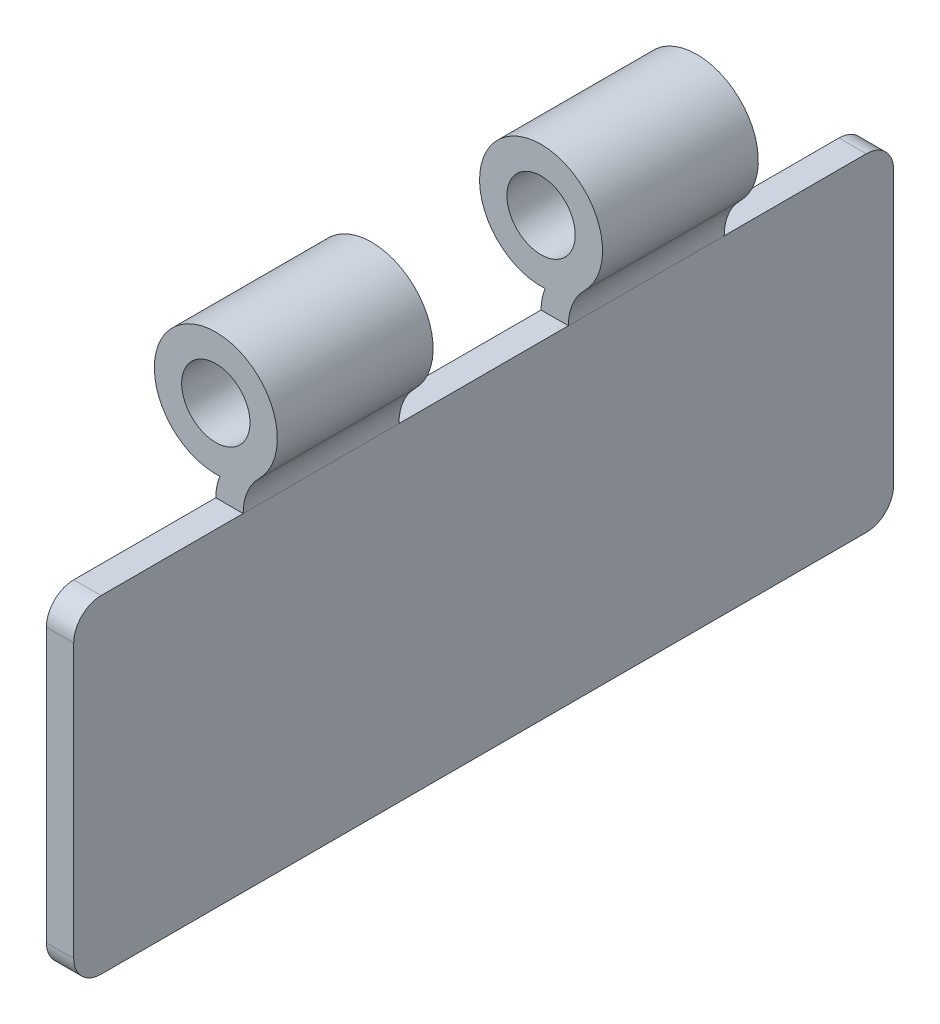
ISO-10303-21;
HEADER;
FILE_DESCRIPTION(('STEP AP214'),'2;1');
FILE_NAME('part.step','',(''),(''),'','','');
FILE_SCHEMA(('AUTOMOTIVE_DESIGN { 1 0 10303 214 1 1 1 1 }'));
ENDSEC;
DATA;
#1=APPLICATION_CONTEXT('core data for automotive mechanical design processes');
#2=APPLICATION_PROTOCOL_DEFINITION('international standard','automotive_design',2000,#1);
#3=PRODUCT_CONTEXT('',#1,'mechanical');
#4=PRODUCT('Part','Part','',(#3));
#5=PRODUCT_RELATED_PRODUCT_CATEGORY('part','',(#4));
#6=PRODUCT_DEFINITION_FORMATION('','',#4);
#7=PRODUCT_DEFINITION_CONTEXT('part definition',#1,'design');
#8=PRODUCT_DEFINITION('design','',#6,#7);
#9=PRODUCT_DEFINITION_SHAPE('','',#8);
#10=(LENGTH_UNIT() NAMED_UNIT(*) SI_UNIT(.MILLI.,.METRE.));
#11=(NAMED_UNIT(*) PLANE_ANGLE_UNIT() SI_UNIT($,.RADIAN.));
#12=(NAMED_UNIT(*) SI_UNIT($,.STERADIAN.) SOLID_ANGLE_UNIT());
#13=UNCERTAINTY_MEASURE_WITH_UNIT(LENGTH_MEASURE(1.E-05),#10,'distance_accuracy_value','');
#14=(GEOMETRIC_REPRESENTATION_CONTEXT(3) GLOBAL_UNCERTAINTY_ASSIGNED_CONTEXT((#13)) GLOBAL_UNIT_ASSIGNED_CONTEXT((#10,
#11,#12)) REPRESENTATION_CONTEXT('',''));
#15=CARTESIAN_POINT('',(0.,0.,0.));
#16=DIRECTION('',(0.,0.,1.));
#17=DIRECTION('',(1.,0.,0.));
#18=AXIS2_PLACEMENT_3D('',#15,#16,#17);
#19=CARTESIAN_POINT('',(0.,38.1,38.1));
#20=DIRECTION('',(0.,0.,-1.));
#21=DIRECTION('',(-1.,0.,0.));
#22=AXIS2_PLACEMENT_3D('',#19,#20,#21);
#23=CYLINDRICAL_SURFACE('',#22,5.715);
#24=CARTESIAN_POINT('',(0.,38.1,-22.352));
#25=DIRECTION('',(0.,0.,1.));
#26=DIRECTION('',(1.,0.,0.));
#27=AXIS2_PLACEMENT_3D('',#24,#25,#26);
#28=CIRCLE('',#27,5.715);
#29=CARTESIAN_POINT('',(4.02417159763314,34.0420118343195,-22.352));
#30=VERTEX_POINT('',#29);
#31=CARTESIAN_POINT('',(0.381023909004146,32.3977157400944,-22.352));
#32=VERTEX_POINT('',#31);
#33=EDGE_CURVE('E156',#30,#32,#28,.T.);
#34=ORIENTED_EDGE('',*,*,#33,.T.);
#35=DIRECTION('',(0.,0.,-1.));
#36=VECTOR('',#35,1.);
#37=CARTESIAN_POINT('',(0.381023909004147,32.3977157400944,38.1));
#38=LINE('',#37,#36);
#39=CARTESIAN_POINT('',(0.381023909004147,32.3977157400944,-7.874));
#40=VERTEX_POINT('',#39);
#41=EDGE_CURVE('E204',#40,#32,#38,.T.);
#42=ORIENTED_EDGE('',*,*,#41,.F.);
#43=CARTESIAN_POINT('',(0.,38.1,-7.874));
#44=DIRECTION('',(0.,0.,1.));
#45=DIRECTION('',(1.,0.,0.));
#46=AXIS2_PLACEMENT_3D('',#43,#44,#45);
#47=CIRCLE('',#46,5.715);
#48=CARTESIAN_POINT('',(4.02417159763314,34.0420118343195,-7.874));
#49=VERTEX_POINT('',#48);
#50=EDGE_CURVE('E181',#49,#40,#47,.T.);
#51=ORIENTED_EDGE('',*,*,#50,.F.);
#52=DIRECTION('',(0.,0.,-1.));
#53=VECTOR('',#52,1.);
#54=CARTESIAN_POINT('',(4.02417159763314,34.0420118343195,38.1));
#55=LINE('',#54,#53);
#56=EDGE_CURVE('E175',#49,#30,#55,.T.);
#57=ORIENTED_EDGE('',*,*,#56,.T.);
#58=EDGE_LOOP('',(#34,#42,#51,#57));
#59=FACE_BOUND('',#58,.T.);
#60=ADVANCED_FACE('F42',(#59),#23,.T.);
#61=CARTESIAN_POINT('',(5.0165,30.48,38.1));
#62=DIRECTION('',(0.,0.,-1.));
#63=DIRECTION('',(-1.,0.,0.));
#64=AXIS2_PLACEMENT_3D('',#61,#62,#63);
#65=CYLINDRICAL_SURFACE('',#64,5.0165);
#66=ORIENTED_EDGE('',*,*,#41,.T.);
#67=CARTESIAN_POINT('',(5.0165,30.48,-22.352));
#68=DIRECTION('',(0.,0.,1.));
#69=DIRECTION('',(1.,0.,0.));
#70=AXIS2_PLACEMENT_3D('',#67,#68,#69);
#71=CIRCLE('',#70,5.0165);
#72=CARTESIAN_POINT('',(0.,30.48,-22.352));
#73=VERTEX_POINT('',#72);
#74=EDGE_CURVE('E163',#32,#73,#71,.T.);
#75=ORIENTED_EDGE('',*,*,#74,.T.);
#76=DIRECTION('',(0.,0.,-1.));
#77=VECTOR('',#76,1.);
#78=CARTESIAN_POINT('',(0.,30.48,38.1));
#79=LINE('',#78,#77);
#80=CARTESIAN_POINT('',(0.,30.48,-7.874));
#81=VERTEX_POINT('',#80);
#82=EDGE_CURVE('E201',#81,#73,#79,.T.);
#83=ORIENTED_EDGE('',*,*,#82,.F.);
#84=CARTESIAN_POINT('',(5.0165,30.48,-7.874));
#85=DIRECTION('',(0.,0.,1.));
#86=DIRECTION('',(1.,0.,0.));
#87=AXIS2_PLACEMENT_3D('',#84,#85,#86);
#88=CIRCLE('',#87,5.0165);
#89=EDGE_CURVE('E282',#81,#40,#88,.F.);
#90=ORIENTED_EDGE('',*,*,#89,.T.);
#91=EDGE_LOOP('',(#66,#75,#83,#90));
#92=FACE_BOUND('',#91,.T.);
#93=ADVANCED_FACE('F311',(#92),#65,.T.);
#94=CARTESIAN_POINT('',(0.,38.1,38.1));
#95=DIRECTION('',(0.,0.,-1.));
#96=DIRECTION('',(-1.,0.,0.));
#97=AXIS2_PLACEMENT_3D('',#94,#95,#96);
#98=CYLINDRICAL_SURFACE('',#97,3.175);
#99=CARTESIAN_POINT('',(0.,38.1,-7.874));
#100=DIRECTION('',(0.,0.,1.));
#101=DIRECTION('',(1.,0.,0.));
#102=AXIS2_PLACEMENT_3D('',#99,#100,#101);
#103=CIRCLE('',#102,3.175);
#104=CARTESIAN_POINT('',(3.175,38.1,-7.874));
#105=VERTEX_POINT('',#104);
#106=EDGE_CURVE('E264',#105,#105,#103,.T.);
#107=ORIENTED_EDGE('',*,*,#106,.T.);
#108=EDGE_LOOP('',(#107));
#109=FACE_BOUND('',#108,.T.);
#110=CARTESIAN_POINT('',(0.,38.1,-22.352));
#111=DIRECTION('',(0.,0.,1.));
#112=DIRECTION('',(1.,0.,0.));
#113=AXIS2_PLACEMENT_3D('',#110,#111,#112);
#114=CIRCLE('',#113,3.175);
#115=CARTESIAN_POINT('',(3.175,38.1,-22.352));
#116=VERTEX_POINT('',#115);
#117=EDGE_CURVE('E168',#116,#116,#114,.T.);
#118=ORIENTED_EDGE('',*,*,#117,.F.);
#119=EDGE_LOOP('',(#118));
#120=FACE_BOUND('',#119,.T.);
#121=ADVANCED_FACE('F309',(#109,#120),#98,.F.);
#122=CARTESIAN_POINT('',(7.55650000000001,30.48,38.1));
#123=DIRECTION('',(0.,0.,-1.));
#124=DIRECTION('',(-1.,0.,0.));
#125=AXIS2_PLACEMENT_3D('',#122,#123,#124);
#126=CYLINDRICAL_SURFACE('',#125,5.0165);
#127=CARTESIAN_POINT('',(7.55650000000001,30.48,-22.352));
#128=DIRECTION('',(0.,0.,-1.));
#129=DIRECTION('',(1.,0.,0.));
#130=AXIS2_PLACEMENT_3D('',#127,#128,#129);
#131=CIRCLE('',#130,5.01650000000001);
#132=CARTESIAN_POINT('',(2.54,30.48,-22.352));
#133=VERTEX_POINT('',#132);
#134=EDGE_CURVE('E161',#133,#30,#131,.T.);
#135=ORIENTED_EDGE('',*,*,#134,.T.);
#136=ORIENTED_EDGE('',*,*,#56,.F.);
#137=CARTESIAN_POINT('',(7.55650000000001,30.48,-7.874));
#138=DIRECTION('',(0.,0.,1.));
#139=DIRECTION('',(1.,0.,0.));
#140=AXIS2_PLACEMENT_3D('',#137,#138,#139);
#141=CIRCLE('',#140,5.0165);
#142=CARTESIAN_POINT('',(2.54,30.48,-7.874));
#143=VERTEX_POINT('',#142);
#144=EDGE_CURVE('E259',#143,#49,#141,.F.);
#145=ORIENTED_EDGE('',*,*,#144,.F.);
#146=DIRECTION('',(0.,0.,-1.));
#147=VECTOR('',#146,1.);
#148=CARTESIAN_POINT('',(2.54,30.48,38.1));
#149=LINE('',#148,#147);
#150=EDGE_CURVE('E177',#143,#133,#149,.T.);
#151=ORIENTED_EDGE('',*,*,#150,.T.);
#152=EDGE_LOOP('',(#135,#136,#145,#151));
#153=FACE_BOUND('',#152,.T.);
#154=ADVANCED_FACE('F173',(#153),#126,.F.);
#155=CARTESIAN_POINT('',(0.,0.,-38.1));
#156=DIRECTION('',(0.,0.,1.));
#157=DIRECTION('',(1.,0.,0.));
#158=AXIS2_PLACEMENT_3D('',#155,#156,#157);
#159=PLANE('',#158);
#160=DIRECTION('',(0.,1.,0.));
#161=VECTOR('',#160,1.);
#162=CARTESIAN_POINT('',(2.54,0.,-38.1));
#163=LINE('',#162,#161);
#164=CARTESIAN_POINT('',(2.54,2.54,-38.1));
#165=VERTEX_POINT('',#164);
#166=CARTESIAN_POINT('',(2.54,27.94,-38.1));
#167=VERTEX_POINT('',#166);
#168=EDGE_CURVE('E190',#165,#167,#163,.T.);
#169=ORIENTED_EDGE('',*,*,#168,.F.);
#170=DIRECTION('',(-1.,0.,0.));
#171=VECTOR('',#170,1.);
#172=CARTESIAN_POINT('',(0.,2.54,-38.1));
#173=LINE('',#172,#171);
#174=CARTESIAN_POINT('',(0.,2.54,-38.1));
#175=VERTEX_POINT('',#174);
#176=EDGE_CURVE('E50',#165,#175,#173,.T.);
#177=ORIENTED_EDGE('',*,*,#176,.T.);
#178=DIRECTION('',(0.,1.,0.));
#179=VECTOR('',#178,1.);
#180=CARTESIAN_POINT('',(0.,0.,-38.1));
#181=LINE('',#180,#179);
#182=CARTESIAN_POINT('',(0.,27.94,-38.1));
#183=VERTEX_POINT('',#182);
#184=EDGE_CURVE('E242',#175,#183,#181,.T.);
#185=ORIENTED_EDGE('',*,*,#184,.T.);
#186=DIRECTION('',(1.,0.,0.));
#187=VECTOR('',#186,1.);
#188=CARTESIAN_POINT('',(2.53999999999998,27.94,-38.1));
#189=LINE('',#188,#187);
#190=EDGE_CURVE('E233',#183,#167,#189,.T.);
#191=ORIENTED_EDGE('',*,*,#190,.T.);
#192=EDGE_LOOP('',(#169,#177,#185,#191));
#193=FACE_BOUND('',#192,.T.);
#194=ADVANCED_FACE('F241',(#193),#159,.F.);
#195=CARTESIAN_POINT('',(0.,38.1,22.352));
#196=DIRECTION('',(0.,0.,1.));
#197=DIRECTION('',(1.,0.,0.));
#198=AXIS2_PLACEMENT_3D('',#195,#196,#197);
#199=CIRCLE('',#198,5.715);
#200=CARTESIAN_POINT('',(4.02417159763314,34.0420118343195,22.352));
#201=VERTEX_POINT('',#200);
#202=CARTESIAN_POINT('',(0.381023909004146,32.3977157400944,22.352));
#203=VERTEX_POINT('',#202);
#204=EDGE_CURVE('E295',#201,#203,#199,.T.);
#205=ORIENTED_EDGE('',*,*,#204,.F.);
#206=CARTESIAN_POINT('',(4.02417159763314,34.0420118343195,7.87400000000001));
#207=VERTEX_POINT('',#206);
#208=EDGE_CURVE('E182',#201,#207,#55,.T.);
#209=ORIENTED_EDGE('',*,*,#208,.T.);
#210=CARTESIAN_POINT('',(0.,38.1,7.874));
#211=DIRECTION('',(0.,0.,1.));
#212=DIRECTION('',(1.,0.,0.));
#213=AXIS2_PLACEMENT_3D('',#210,#211,#212);
#214=CIRCLE('',#213,5.715);
#215=CARTESIAN_POINT('',(0.381023909004147,32.3977157400944,7.874));
#216=VERTEX_POINT('',#215);
#217=EDGE_CURVE('E271',#207,#216,#214,.T.);
#218=ORIENTED_EDGE('',*,*,#217,.T.);
#219=EDGE_CURVE('E206',#203,#216,#38,.T.);
#220=ORIENTED_EDGE('',*,*,#219,.F.);
#221=EDGE_LOOP('',(#205,#209,#218,#220));
#222=FACE_BOUND('',#221,.T.);
#223=ADVANCED_FACE('F329',(#222),#23,.T.);
#224=CARTESIAN_POINT('',(0.,30.48,22.352));
#225=VERTEX_POINT('',#224);
#226=CARTESIAN_POINT('',(0.,30.48,7.874));
#227=VERTEX_POINT('',#226);
#228=EDGE_CURVE('E205',#225,#227,#79,.T.);
#229=ORIENTED_EDGE('',*,*,#228,.F.);
#230=CARTESIAN_POINT('',(5.0165,30.48,22.352));
#231=DIRECTION('',(0.,0.,1.));
#232=DIRECTION('',(1.,0.,0.));
#233=AXIS2_PLACEMENT_3D('',#230,#231,#232);
#234=CIRCLE('',#233,5.0165);
#235=EDGE_CURVE('E292',#203,#225,#234,.T.);
#236=ORIENTED_EDGE('',*,*,#235,.F.);
#237=ORIENTED_EDGE('',*,*,#219,.T.);
#238=CARTESIAN_POINT('',(5.0165,30.48,7.874));
#239=DIRECTION('',(0.,0.,1.));
#240=DIRECTION('',(1.,0.,0.));
#241=AXIS2_PLACEMENT_3D('',#238,#239,#240);
#242=CIRCLE('',#241,5.0165);
#243=EDGE_CURVE('E268',#227,#216,#242,.F.);
#244=ORIENTED_EDGE('',*,*,#243,.F.);
#245=EDGE_LOOP('',(#229,#236,#237,#244));
#246=FACE_BOUND('',#245,.T.);
#247=ADVANCED_FACE('F323',(#246),#65,.T.);
#248=CARTESIAN_POINT('',(0.,38.1,7.874));
#249=DIRECTION('',(0.,0.,1.));
#250=DIRECTION('',(1.,0.,0.));
#251=AXIS2_PLACEMENT_3D('',#248,#249,#250);
#252=CIRCLE('',#251,3.175);
#253=CARTESIAN_POINT('',(3.175,38.1,7.874));
#254=VERTEX_POINT('',#253);
#255=EDGE_CURVE('E274',#254,#254,#252,.T.);
#256=ORIENTED_EDGE('',*,*,#255,.F.);
#257=EDGE_LOOP('',(#256));
#258=FACE_BOUND('',#257,.T.);
#259=CARTESIAN_POINT('',(0.,38.1,22.352));
#260=DIRECTION('',(0.,0.,1.));
#261=DIRECTION('',(1.,0.,0.));
#262=AXIS2_PLACEMENT_3D('',#259,#260,#261);
#263=CIRCLE('',#262,3.175);
#264=CARTESIAN_POINT('',(3.175,38.1,22.352));
#265=VERTEX_POINT('',#264);
#266=EDGE_CURVE('E297',#265,#265,#263,.T.);
#267=ORIENTED_EDGE('',*,*,#266,.T.);
#268=EDGE_LOOP('',(#267));
#269=FACE_BOUND('',#268,.T.);
#270=ADVANCED_FACE('F314',(#258,#269),#98,.F.);
#271=CARTESIAN_POINT('',(7.55650000000001,30.48,22.352));
#272=DIRECTION('',(0.,0.,-1.));
#273=DIRECTION('',(1.,0.,0.));
#274=AXIS2_PLACEMENT_3D('',#271,#272,#273);
#275=CIRCLE('',#274,5.01650000000001);
#276=CARTESIAN_POINT('',(2.54,30.48,22.352));
#277=VERTEX_POINT('',#276);
#278=EDGE_CURVE('E277',#277,#201,#275,.T.);
#279=ORIENTED_EDGE('',*,*,#278,.F.);
#280=CARTESIAN_POINT('',(2.54,30.48,7.874));
#281=VERTEX_POINT('',#280);
#282=EDGE_CURVE('E195',#277,#281,#149,.T.);
#283=ORIENTED_EDGE('',*,*,#282,.T.);
#284=CARTESIAN_POINT('',(7.55650000000001,30.48,7.874));
#285=DIRECTION('',(0.,0.,1.));
#286=DIRECTION('',(1.,0.,0.));
#287=AXIS2_PLACEMENT_3D('',#284,#285,#286);
#288=CIRCLE('',#287,5.0165);
#289=EDGE_CURVE('E261',#281,#207,#288,.F.);
#290=ORIENTED_EDGE('',*,*,#289,.T.);
#291=ORIENTED_EDGE('',*,*,#208,.F.);
#292=EDGE_LOOP('',(#279,#283,#290,#291));
#293=FACE_BOUND('',#292,.T.);
#294=ADVANCED_FACE('F320',(#293),#126,.F.);
#295=CARTESIAN_POINT('',(0.,0.,38.1));
#296=DIRECTION('',(-1.,0.,0.));
#297=DIRECTION('',(0.,0.,1.));
#298=AXIS2_PLACEMENT_3D('',#295,#296,#297);
#299=PLANE('',#298);
#300=DIRECTION('',(0.,0.,-1.));
#301=VECTOR('',#300,1.);
#302=CARTESIAN_POINT('',(0.,0.,38.1));
#303=LINE('',#302,#301);
#304=CARTESIAN_POINT('',(0.,0.,35.56));
#305=VERTEX_POINT('',#304);
#306=CARTESIAN_POINT('',(0.,0.,-35.56));
#307=VERTEX_POINT('',#306);
#308=EDGE_CURVE('E198',#305,#307,#303,.T.);
#309=ORIENTED_EDGE('',*,*,#308,.F.);
#310=CARTESIAN_POINT('',(0.,2.54,35.56));
#311=DIRECTION('',(-1.,0.,0.));
#312=DIRECTION('',(0.,0.,1.));
#313=AXIS2_PLACEMENT_3D('',#310,#311,#312);
#314=CIRCLE('',#313,2.54);
#315=CARTESIAN_POINT('',(0.,2.54,38.1));
#316=VERTEX_POINT('',#315);
#317=EDGE_CURVE('E219',#305,#316,#314,.T.);
#318=ORIENTED_EDGE('',*,*,#317,.T.);
#319=DIRECTION('',(0.,1.,0.));
#320=VECTOR('',#319,1.);
#321=CARTESIAN_POINT('',(0.,0.,38.1));
#322=LINE('',#321,#320);
#323=CARTESIAN_POINT('',(0.,27.94,38.1));
#324=VERTEX_POINT('',#323);
#325=EDGE_CURVE('E186',#316,#324,#322,.T.);
#326=ORIENTED_EDGE('',*,*,#325,.T.);
#327=CARTESIAN_POINT('',(0.,27.94,35.56));
#328=DIRECTION('',(-1.,0.,0.));
#329=DIRECTION('',(0.,0.,1.));
#330=AXIS2_PLACEMENT_3D('',#327,#328,#329);
#331=CIRCLE('',#330,2.54);
#332=CARTESIAN_POINT('',(0.,30.48,35.56));
#333=VERTEX_POINT('',#332);
#334=EDGE_CURVE('E217',#324,#333,#331,.T.);
#335=ORIENTED_EDGE('',*,*,#334,.T.);
#336=EDGE_CURVE('E202',#333,#225,#79,.T.);
#337=ORIENTED_EDGE('',*,*,#336,.T.);
#338=ORIENTED_EDGE('',*,*,#228,.T.);
#339=DIRECTION('',(0.,0.,1.));
#340=VECTOR('',#339,1.);
#341=CARTESIAN_POINT('',(0.,30.48,-7.874));
#342=LINE('',#341,#340);
#343=EDGE_CURVE('E253',#81,#227,#342,.T.);
#344=ORIENTED_EDGE('',*,*,#343,.F.);
#345=ORIENTED_EDGE('',*,*,#82,.T.);
#346=DIRECTION('',(0.,0.,-1.));
#347=VECTOR('',#346,1.);
#348=CARTESIAN_POINT('',(0.,30.48,-22.352));
#349=LINE('',#348,#347);
#350=CARTESIAN_POINT('',(0.,30.48,-35.56));
#351=VERTEX_POINT('',#350);
#352=EDGE_CURVE('E300',#73,#351,#349,.T.);
#353=ORIENTED_EDGE('',*,*,#352,.T.);
#354=CARTESIAN_POINT('',(0.,27.94,-35.56));
#355=DIRECTION('',(-1.,0.,0.));
#356=DIRECTION('',(0.,0.,1.));
#357=AXIS2_PLACEMENT_3D('',#354,#355,#356);
#358=CIRCLE('',#357,2.54);
#359=EDGE_CURVE('E213',#351,#183,#358,.T.);
#360=ORIENTED_EDGE('',*,*,#359,.T.);
#361=ORIENTED_EDGE('',*,*,#184,.F.);
#362=CARTESIAN_POINT('',(0.,2.54,-35.56));
#363=DIRECTION('',(-1.,0.,0.));
#364=DIRECTION('',(0.,0.,1.));
#365=AXIS2_PLACEMENT_3D('',#362,#363,#364);
#366=CIRCLE('',#365,2.54);
#367=EDGE_CURVE('E215',#175,#307,#366,.T.);
#368=ORIENTED_EDGE('',*,*,#367,.T.);
#369=EDGE_LOOP('',(#309,#318,#326,#335,#337,#338,#344,#345,#353,#360,#361,#368));
#370=FACE_BOUND('',#369,.T.);
#371=ADVANCED_FACE('F248',(#370),#299,.T.);
#372=CARTESIAN_POINT('',(0.,0.,38.1));
#373=DIRECTION('',(0.,-1.,0.));
#374=DIRECTION('',(1.,0.,0.));
#375=AXIS2_PLACEMENT_3D('',#372,#373,#374);
#376=PLANE('',#375);
#377=DIRECTION('',(0.,0.,-1.));
#378=VECTOR('',#377,1.);
#379=CARTESIAN_POINT('',(2.54,0.,38.1));
#380=LINE('',#379,#378);
#381=CARTESIAN_POINT('',(2.54,0.,35.56));
#382=VERTEX_POINT('',#381);
#383=CARTESIAN_POINT('',(2.54,0.,-35.56));
#384=VERTEX_POINT('',#383);
#385=EDGE_CURVE('E194',#382,#384,#380,.T.);
#386=ORIENTED_EDGE('',*,*,#385,.F.);
#387=DIRECTION('',(-1.,0.,0.));
#388=VECTOR('',#387,1.);
#389=CARTESIAN_POINT('',(0.,0.,35.56));
#390=LINE('',#389,#388);
#391=EDGE_CURVE('E210',#382,#305,#390,.T.);
#392=ORIENTED_EDGE('',*,*,#391,.T.);
#393=ORIENTED_EDGE('',*,*,#308,.T.);
#394=DIRECTION('',(-1.,0.,0.));
#395=VECTOR('',#394,1.);
#396=CARTESIAN_POINT('',(2.54,0.,-35.56));
#397=LINE('',#396,#395);
#398=EDGE_CURVE('E208',#307,#384,#397,.F.);
#399=ORIENTED_EDGE('',*,*,#398,.T.);
#400=EDGE_LOOP('',(#386,#392,#393,#399));
#401=FACE_BOUND('',#400,.T.);
#402=ADVANCED_FACE('F383',(#401),#376,.T.);
#403=CARTESIAN_POINT('',(2.54,0.,38.1));
#404=DIRECTION('',(-1.,0.,0.));
#405=DIRECTION('',(0.,0.,1.));
#406=AXIS2_PLACEMENT_3D('',#403,#404,#405);
#407=PLANE('',#406);
#408=DIRECTION('',(0.,1.,0.));
#409=VECTOR('',#408,1.);
#410=CARTESIAN_POINT('',(2.54,0.,38.1));
#411=LINE('',#410,#409);
#412=CARTESIAN_POINT('',(2.54,2.54,38.1));
#413=VERTEX_POINT('',#412);
#414=CARTESIAN_POINT('',(2.54,27.94,38.1));
#415=VERTEX_POINT('',#414);
#416=EDGE_CURVE('E183',#413,#415,#411,.T.);
#417=ORIENTED_EDGE('',*,*,#416,.F.);
#418=CARTESIAN_POINT('',(2.54,2.54,35.56));
#419=DIRECTION('',(-1.,0.,0.));
#420=DIRECTION('',(0.,0.,1.));
#421=AXIS2_PLACEMENT_3D('',#418,#419,#420);
#422=CIRCLE('',#421,2.54);
#423=EDGE_CURVE('E229',#413,#382,#422,.F.);
#424=ORIENTED_EDGE('',*,*,#423,.T.);
#425=ORIENTED_EDGE('',*,*,#385,.T.);
#426=CARTESIAN_POINT('',(2.54,2.54,-35.56));
#427=DIRECTION('',(-1.,0.,0.));
#428=DIRECTION('',(0.,0.,1.));
#429=AXIS2_PLACEMENT_3D('',#426,#427,#428);
#430=CIRCLE('',#429,2.54);
#431=EDGE_CURVE('E226',#384,#165,#430,.F.);
#432=ORIENTED_EDGE('',*,*,#431,.T.);
#433=ORIENTED_EDGE('',*,*,#168,.T.);
#434=CARTESIAN_POINT('',(2.54,27.94,-35.56));
#435=DIRECTION('',(-1.,0.,0.));
#436=DIRECTION('',(0.,0.,1.));
#437=AXIS2_PLACEMENT_3D('',#434,#435,#436);
#438=CIRCLE('',#437,2.54);
#439=CARTESIAN_POINT('',(2.54,30.48,-35.56));
#440=VERTEX_POINT('',#439);
#441=EDGE_CURVE('E65',#167,#440,#438,.F.);
#442=ORIENTED_EDGE('',*,*,#441,.T.);
#443=DIRECTION('',(0.,0.,-1.));
#444=VECTOR('',#443,1.);
#445=CARTESIAN_POINT('',(2.54,30.48,-22.352));
#446=LINE('',#445,#444);
#447=EDGE_CURVE('E301',#133,#440,#446,.T.);
#448=ORIENTED_EDGE('',*,*,#447,.F.);
#449=ORIENTED_EDGE('',*,*,#150,.F.);
#450=DIRECTION('',(0.,0.,1.));
#451=VECTOR('',#450,1.);
#452=CARTESIAN_POINT('',(2.54,30.48,-7.874));
#453=LINE('',#452,#451);
#454=EDGE_CURVE('E251',#143,#281,#453,.T.);
#455=ORIENTED_EDGE('',*,*,#454,.T.);
#456=ORIENTED_EDGE('',*,*,#282,.F.);
#457=CARTESIAN_POINT('',(2.54,30.48,35.56));
#458=VERTEX_POINT('',#457);
#459=EDGE_CURVE('E192',#458,#277,#149,.T.);
#460=ORIENTED_EDGE('',*,*,#459,.F.);
#461=CARTESIAN_POINT('',(2.54,27.94,35.56));
#462=DIRECTION('',(-1.,0.,0.));
#463=DIRECTION('',(0.,0.,1.));
#464=AXIS2_PLACEMENT_3D('',#461,#462,#463);
#465=CIRCLE('',#464,2.54);
#466=EDGE_CURVE('E57',#458,#415,#465,.F.);
#467=ORIENTED_EDGE('',*,*,#466,.T.);
#468=EDGE_LOOP('',(#417,#424,#425,#432,#433,#442,#448,#449,#455,#456,#460,#467));
#469=FACE_BOUND('',#468,.T.);
#470=ADVANCED_FACE('F355',(#469),#407,.F.);
#471=CARTESIAN_POINT('',(0.,0.,38.1));
#472=DIRECTION('',(0.,0.,1.));
#473=DIRECTION('',(1.,0.,0.));
#474=AXIS2_PLACEMENT_3D('',#471,#472,#473);
#475=PLANE('',#474);
#476=ORIENTED_EDGE('',*,*,#325,.F.);
#477=DIRECTION('',(-1.,0.,0.));
#478=VECTOR('',#477,1.);
#479=CARTESIAN_POINT('',(0.,2.54,38.1));
#480=LINE('',#479,#478);
#481=EDGE_CURVE('E223',#316,#413,#480,.F.);
#482=ORIENTED_EDGE('',*,*,#481,.T.);
#483=ORIENTED_EDGE('',*,*,#416,.T.);
#484=DIRECTION('',(1.,0.,0.));
#485=VECTOR('',#484,1.);
#486=CARTESIAN_POINT('',(0.,27.94,38.1));
#487=LINE('',#486,#485);
#488=EDGE_CURVE('E221',#415,#324,#487,.F.);
#489=ORIENTED_EDGE('',*,*,#488,.T.);
#490=EDGE_LOOP('',(#476,#482,#483,#489));
#491=FACE_BOUND('',#490,.T.);
#492=ADVANCED_FACE('F374',(#491),#475,.T.);
#493=CARTESIAN_POINT('',(2.08166817117217E-13,30.48,-7.874));
#494=DIRECTION('',(0.,1.,0.));
#495=DIRECTION('',(-1.,0.,0.));
#496=AXIS2_PLACEMENT_3D('',#493,#494,#495);
#497=PLANE('',#496);
#498=DIRECTION('',(-1.,0.,0.));
#499=VECTOR('',#498,1.);
#500=CARTESIAN_POINT('',(2.08166817117217E-13,30.48,7.874));
#501=LINE('',#500,#499);
#502=EDGE_CURVE('E265',#281,#227,#501,.T.);
#503=ORIENTED_EDGE('',*,*,#502,.F.);
#504=ORIENTED_EDGE('',*,*,#454,.F.);
#505=DIRECTION('',(-1.,0.,0.));
#506=VECTOR('',#505,1.);
#507=CARTESIAN_POINT('',(2.08166817117217E-13,30.48,-7.874));
#508=LINE('',#507,#506);
#509=EDGE_CURVE('E279',#143,#81,#508,.T.);
#510=ORIENTED_EDGE('',*,*,#509,.T.);
#511=ORIENTED_EDGE('',*,*,#343,.T.);
#512=EDGE_LOOP('',(#503,#504,#510,#511));
#513=FACE_BOUND('',#512,.T.);
#514=ADVANCED_FACE('F359',(#513),#497,.T.);
#515=CARTESIAN_POINT('',(0.,0.,-7.874));
#516=DIRECTION('',(0.,0.,1.));
#517=DIRECTION('',(1.,0.,0.));
#518=AXIS2_PLACEMENT_3D('',#515,#516,#517);
#519=PLANE('',#518);
#520=ORIENTED_EDGE('',*,*,#106,.F.);
#521=EDGE_LOOP('',(#520));
#522=FACE_BOUND('',#521,.T.);
#523=ORIENTED_EDGE('',*,*,#50,.T.);
#524=ORIENTED_EDGE('',*,*,#89,.F.);
#525=ORIENTED_EDGE('',*,*,#509,.F.);
#526=ORIENTED_EDGE('',*,*,#144,.T.);
#527=EDGE_LOOP('',(#523,#524,#525,#526));
#528=FACE_BOUND('',#527,.T.);
#529=ADVANCED_FACE('F362',(#522,#528),#519,.T.);
#530=CARTESIAN_POINT('',(0.,0.,7.874));
#531=DIRECTION('',(0.,0.,1.));
#532=DIRECTION('',(1.,0.,0.));
#533=AXIS2_PLACEMENT_3D('',#530,#531,#532);
#534=PLANE('',#533);
#535=ORIENTED_EDGE('',*,*,#255,.T.);
#536=EDGE_LOOP('',(#535));
#537=FACE_BOUND('',#536,.T.);
#538=ORIENTED_EDGE('',*,*,#217,.F.);
#539=ORIENTED_EDGE('',*,*,#289,.F.);
#540=ORIENTED_EDGE('',*,*,#502,.T.);
#541=ORIENTED_EDGE('',*,*,#243,.T.);
#542=EDGE_LOOP('',(#538,#539,#540,#541));
#543=FACE_BOUND('',#542,.T.);
#544=ADVANCED_FACE('F352',(#537,#543),#534,.F.);
#545=CARTESIAN_POINT('',(2.54,30.48,22.352));
#546=DIRECTION('',(0.,-1.,0.));
#547=DIRECTION('',(1.,0.,0.));
#548=AXIS2_PLACEMENT_3D('',#545,#546,#547);
#549=PLANE('',#548);
#550=ORIENTED_EDGE('',*,*,#336,.F.);
#551=DIRECTION('',(1.,0.,0.));
#552=VECTOR('',#551,1.);
#553=CARTESIAN_POINT('',(2.54,30.48,35.56));
#554=LINE('',#553,#552);
#555=EDGE_CURVE('E231',#333,#458,#554,.T.);
#556=ORIENTED_EDGE('',*,*,#555,.T.);
#557=ORIENTED_EDGE('',*,*,#459,.T.);
#558=DIRECTION('',(1.,0.,0.));
#559=VECTOR('',#558,1.);
#560=CARTESIAN_POINT('',(2.54,30.48,22.352));
#561=LINE('',#560,#559);
#562=EDGE_CURVE('E289',#225,#277,#561,.T.);
#563=ORIENTED_EDGE('',*,*,#562,.F.);
#564=EDGE_LOOP('',(#550,#556,#557,#563));
#565=FACE_BOUND('',#564,.T.);
#566=ADVANCED_FACE('F370',(#565),#549,.F.);
#567=CARTESIAN_POINT('',(0.,38.1,22.352));
#568=DIRECTION('',(0.,0.,1.));
#569=DIRECTION('',(1.,0.,0.));
#570=AXIS2_PLACEMENT_3D('',#567,#568,#569);
#571=PLANE('',#570);
#572=ORIENTED_EDGE('',*,*,#266,.F.);
#573=EDGE_LOOP('',(#572));
#574=FACE_BOUND('',#573,.T.);
#575=ORIENTED_EDGE('',*,*,#204,.T.);
#576=ORIENTED_EDGE('',*,*,#235,.T.);
#577=ORIENTED_EDGE('',*,*,#562,.T.);
#578=ORIENTED_EDGE('',*,*,#278,.T.);
#579=EDGE_LOOP('',(#575,#576,#577,#578));
#580=FACE_BOUND('',#579,.T.);
#581=ADVANCED_FACE('F368',(#574,#580),#571,.T.);
#582=CARTESIAN_POINT('',(0.,38.1,-22.352));
#583=DIRECTION('',(0.,0.,-1.));
#584=DIRECTION('',(1.,0.,0.));
#585=AXIS2_PLACEMENT_3D('',#582,#583,#584);
#586=PLANE('',#585);
#587=ORIENTED_EDGE('',*,*,#33,.F.);
#588=ORIENTED_EDGE('',*,*,#134,.F.);
#589=DIRECTION('',(1.,0.,0.));
#590=VECTOR('',#589,1.);
#591=CARTESIAN_POINT('',(2.54,30.48,-22.352));
#592=LINE('',#591,#590);
#593=EDGE_CURVE('E178',#73,#133,#592,.T.);
#594=ORIENTED_EDGE('',*,*,#593,.F.);
#595=ORIENTED_EDGE('',*,*,#74,.F.);
#596=EDGE_LOOP('',(#587,#588,#594,#595));
#597=FACE_BOUND('',#596,.T.);
#598=ORIENTED_EDGE('',*,*,#117,.T.);
#599=EDGE_LOOP('',(#598));
#600=FACE_BOUND('',#599,.T.);
#601=ADVANCED_FACE('F158',(#597,#600),#586,.T.);
#602=CARTESIAN_POINT('',(2.54,30.48,-22.352));
#603=DIRECTION('',(0.,1.,0.));
#604=DIRECTION('',(-1.,0.,0.));
#605=AXIS2_PLACEMENT_3D('',#602,#603,#604);
#606=PLANE('',#605);
#607=ORIENTED_EDGE('',*,*,#447,.T.);
#608=DIRECTION('',(1.,0.,0.));
#609=VECTOR('',#608,1.);
#610=CARTESIAN_POINT('',(0.,30.48,-35.56));
#611=LINE('',#610,#609);
#612=EDGE_CURVE('E11',#440,#351,#611,.F.);
#613=ORIENTED_EDGE('',*,*,#612,.T.);
#614=ORIENTED_EDGE('',*,*,#352,.F.);
#615=ORIENTED_EDGE('',*,*,#593,.T.);
#616=EDGE_LOOP('',(#607,#613,#614,#615));
#617=FACE_BOUND('',#616,.T.);
#618=ADVANCED_FACE('F394',(#617),#606,.T.);
#619=CARTESIAN_POINT('',(0.,2.54,35.56));
#620=DIRECTION('',(-1.,0.,0.));
#621=DIRECTION('',(0.,-1.,0.));
#622=AXIS2_PLACEMENT_3D('',#619,#620,#621);
#623=CYLINDRICAL_SURFACE('',#622,2.54);
#624=ORIENTED_EDGE('',*,*,#423,.F.);
#625=ORIENTED_EDGE('',*,*,#481,.F.);
#626=ORIENTED_EDGE('',*,*,#317,.F.);
#627=ORIENTED_EDGE('',*,*,#391,.F.);
#628=EDGE_LOOP('',(#624,#625,#626,#627));
#629=FACE_BOUND('',#628,.T.);
#630=ADVANCED_FACE('F379',(#629),#623,.T.);
#631=CARTESIAN_POINT('',(2.53999999999998,27.94,35.56));
#632=DIRECTION('',(-1.,0.,0.));
#633=DIRECTION('',(0.,-1.,0.));
#634=AXIS2_PLACEMENT_3D('',#631,#632,#633);
#635=CYLINDRICAL_SURFACE('',#634,2.54);
#636=ORIENTED_EDGE('',*,*,#334,.F.);
#637=ORIENTED_EDGE('',*,*,#488,.F.);
#638=ORIENTED_EDGE('',*,*,#466,.F.);
#639=ORIENTED_EDGE('',*,*,#555,.F.);
#640=EDGE_LOOP('',(#636,#637,#638,#639));
#641=FACE_BOUND('',#640,.T.);
#642=ADVANCED_FACE('F377',(#641),#635,.T.);
#643=CARTESIAN_POINT('',(0.,2.54,-35.56));
#644=DIRECTION('',(1.,0.,0.));
#645=DIRECTION('',(0.,1.,0.));
#646=AXIS2_PLACEMENT_3D('',#643,#644,#645);
#647=CYLINDRICAL_SURFACE('',#646,2.54);
#648=ORIENTED_EDGE('',*,*,#431,.F.);
#649=ORIENTED_EDGE('',*,*,#398,.F.);
#650=ORIENTED_EDGE('',*,*,#367,.F.);
#651=ORIENTED_EDGE('',*,*,#176,.F.);
#652=EDGE_LOOP('',(#648,#649,#650,#651));
#653=FACE_BOUND('',#652,.T.);
#654=ADVANCED_FACE('F385',(#653),#647,.T.);
#655=CARTESIAN_POINT('',(1.90819582357449E-13,27.94,-35.56));
#656=DIRECTION('',(-1.,0.,0.));
#657=DIRECTION('',(0.,-1.,0.));
#658=AXIS2_PLACEMENT_3D('',#655,#656,#657);
#659=CYLINDRICAL_SURFACE('',#658,2.54);
#660=ORIENTED_EDGE('',*,*,#359,.F.);
#661=ORIENTED_EDGE('',*,*,#612,.F.);
#662=ORIENTED_EDGE('',*,*,#441,.F.);
#663=ORIENTED_EDGE('',*,*,#190,.F.);
#664=EDGE_LOOP('',(#660,#661,#662,#663));
#665=FACE_BOUND('',#664,.T.);
#666=ADVANCED_FACE('F44',(#665),#659,.T.);
#667=CLOSED_SHELL('',(#60,#93,#121,#154,#194,#223,#247,#270,#294,#371,#402,#470,#492,#514,#529,
#544,#566,#581,#601,#618,#630,#642,#654,#666));
#668=MANIFOLD_SOLID_BREP('B2',#667);
#669=ADVANCED_BREP_SHAPE_REPRESENTATION('',(#18,#668),#14);
#670=SHAPE_DEFINITION_REPRESENTATION(#9,#669);
ENDSEC;
END-ISO-10303-21;
